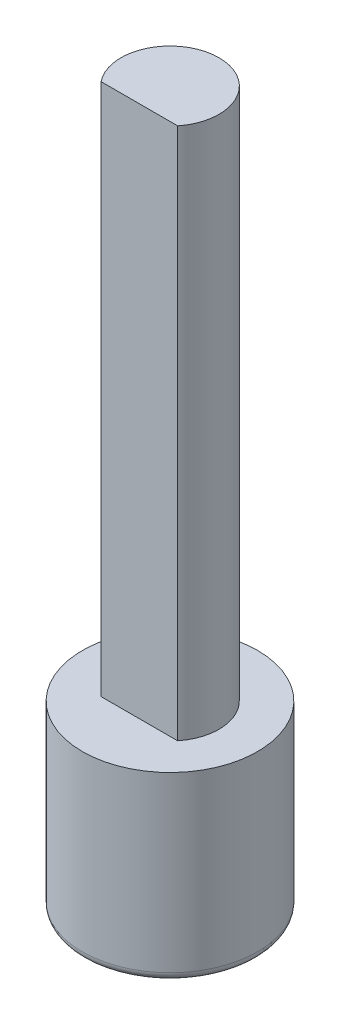
ISO-10303-21;
HEADER;
FILE_DESCRIPTION(('STEP AP214'),'2;1');
FILE_NAME('part.step','',(''),(''),'','','');
FILE_SCHEMA(('AUTOMOTIVE_DESIGN { 1 0 10303 214 1 1 1 1 }'));
ENDSEC;
DATA;
#1=APPLICATION_CONTEXT('core data for automotive mechanical design processes');
#2=APPLICATION_PROTOCOL_DEFINITION('international standard','automotive_design',2000,#1);
#3=PRODUCT_CONTEXT('',#1,'mechanical');
#4=PRODUCT('Part','Part','',(#3));
#5=PRODUCT_RELATED_PRODUCT_CATEGORY('part','',(#4));
#6=PRODUCT_DEFINITION_FORMATION('','',#4);
#7=PRODUCT_DEFINITION_CONTEXT('part definition',#1,'design');
#8=PRODUCT_DEFINITION('design','',#6,#7);
#9=PRODUCT_DEFINITION_SHAPE('','',#8);
#10=(LENGTH_UNIT() NAMED_UNIT(*) SI_UNIT(.MILLI.,.METRE.));
#11=(NAMED_UNIT(*) PLANE_ANGLE_UNIT() SI_UNIT($,.RADIAN.));
#12=(NAMED_UNIT(*) SI_UNIT($,.STERADIAN.) SOLID_ANGLE_UNIT());
#13=UNCERTAINTY_MEASURE_WITH_UNIT(LENGTH_MEASURE(1.E-05),#10,'distance_accuracy_value','');
#14=(GEOMETRIC_REPRESENTATION_CONTEXT(3) GLOBAL_UNCERTAINTY_ASSIGNED_CONTEXT((#13)) GLOBAL_UNIT_ASSIGNED_CONTEXT((#10,
#11,#12)) REPRESENTATION_CONTEXT('',''));
#15=CARTESIAN_POINT('',(0.,0.,0.));
#16=DIRECTION('',(0.,0.,1.));
#17=DIRECTION('',(1.,0.,0.));
#18=AXIS2_PLACEMENT_3D('',#15,#16,#17);
#19=CARTESIAN_POINT('',(0.,0.,0.));
#20=DIRECTION('',(0.,1.,0.));
#21=DIRECTION('',(0.,0.,1.));
#22=AXIS2_PLACEMENT_3D('',#19,#20,#21);
#23=PLANE('',#22);
#24=CARTESIAN_POINT('',(0.,0.,0.));
#25=DIRECTION('',(0.,1.,0.));
#26=DIRECTION('',(0.,0.,1.));
#27=AXIS2_PLACEMENT_3D('',#24,#25,#26);
#28=CIRCLE('',#27,2.25);
#29=CARTESIAN_POINT('',(0.,0.,2.25));
#30=VERTEX_POINT('',#29);
#31=EDGE_CURVE('E11',#30,#30,#28,.F.);
#32=ORIENTED_EDGE('',*,*,#31,.T.);
#33=EDGE_LOOP('',(#32));
#34=FACE_BOUND('',#33,.T.);
#35=ADVANCED_FACE('F45',(#34),#23,.F.);
#36=CARTESIAN_POINT('',(0.,20.4,0.));
#37=DIRECTION('',(0.,1.,0.));
#38=DIRECTION('',(0.,0.,1.));
#39=AXIS2_PLACEMENT_3D('',#36,#37,#38);
#40=CYLINDRICAL_SURFACE('',#39,2.5);
#41=CARTESIAN_POINT('',(0.,0.25,0.));
#42=DIRECTION('',(0.,1.,0.));
#43=DIRECTION('',(0.,0.,1.));
#44=AXIS2_PLACEMENT_3D('',#41,#42,#43);
#45=CIRCLE('',#44,2.5);
#46=CARTESIAN_POINT('',(0.,0.25,2.5));
#47=VERTEX_POINT('',#46);
#48=EDGE_CURVE('E54',#47,#47,#45,.T.);
#49=ORIENTED_EDGE('',*,*,#48,.T.);
#50=EDGE_LOOP('',(#49));
#51=FACE_BOUND('',#50,.T.);
#52=CARTESIAN_POINT('',(0.,5.2,0.));
#53=DIRECTION('',(0.,1.,0.));
#54=DIRECTION('',(0.,0.,1.));
#55=AXIS2_PLACEMENT_3D('',#52,#53,#54);
#56=CIRCLE('',#55,2.5);
#57=CARTESIAN_POINT('',(0.,5.2,2.5));
#58=VERTEX_POINT('',#57);
#59=EDGE_CURVE('E89',#58,#58,#56,.T.);
#60=ORIENTED_EDGE('',*,*,#59,.F.);
#61=EDGE_LOOP('',(#60));
#62=FACE_BOUND('',#61,.T.);
#63=ADVANCED_FACE('F102',(#51,#62),#40,.T.);
#64=CARTESIAN_POINT('',(0.,5.2,-2.5));
#65=DIRECTION('',(0.,-1.,0.));
#66=DIRECTION('',(0.,0.,-1.));
#67=AXIS2_PLACEMENT_3D('',#64,#65,#66);
#68=PLANE('',#67);
#69=CARTESIAN_POINT('',(0.,5.2,0.));
#70=DIRECTION('',(0.,1.,0.));
#71=DIRECTION('',(0.,0.,1.));
#72=AXIS2_PLACEMENT_3D('',#69,#70,#71);
#73=CIRCLE('',#72,1.4);
#74=CARTESIAN_POINT('',(1.09287464971972,5.2,0.875));
#75=VERTEX_POINT('',#74);
#76=CARTESIAN_POINT('',(-1.09287464971972,5.2,0.875));
#77=VERTEX_POINT('',#76);
#78=EDGE_CURVE('E84',#75,#77,#73,.T.);
#79=ORIENTED_EDGE('',*,*,#78,.F.);
#80=DIRECTION('',(-1.,0.,0.));
#81=VECTOR('',#80,1.);
#82=CARTESIAN_POINT('',(1.09287464971972,5.2,0.875));
#83=LINE('',#82,#81);
#84=EDGE_CURVE('E73',#75,#77,#83,.T.);
#85=ORIENTED_EDGE('',*,*,#84,.T.);
#86=EDGE_LOOP('',(#79,#85));
#87=FACE_BOUND('',#86,.T.);
#88=ORIENTED_EDGE('',*,*,#59,.T.);
#89=EDGE_LOOP('',(#88));
#90=FACE_BOUND('',#89,.T.);
#91=ADVANCED_FACE('F82',(#87,#90),#68,.F.);
#92=CARTESIAN_POINT('',(0.,20.4,0.));
#93=DIRECTION('',(0.,1.,0.));
#94=DIRECTION('',(0.,0.,1.));
#95=AXIS2_PLACEMENT_3D('',#92,#93,#94);
#96=CYLINDRICAL_SURFACE('',#95,1.4);
#97=ORIENTED_EDGE('',*,*,#78,.T.);
#98=DIRECTION('',(0.,1.,0.));
#99=VECTOR('',#98,1.);
#100=CARTESIAN_POINT('',(-1.09287464971972,2.9520842987336,0.875));
#101=LINE('',#100,#99);
#102=CARTESIAN_POINT('',(-1.09287464971972,20.4,0.875));
#103=VERTEX_POINT('',#102);
#104=EDGE_CURVE('E70',#77,#103,#101,.T.);
#105=ORIENTED_EDGE('',*,*,#104,.T.);
#106=CARTESIAN_POINT('',(0.,20.4,0.));
#107=DIRECTION('',(0.,1.,0.));
#108=DIRECTION('',(0.,0.,1.));
#109=AXIS2_PLACEMENT_3D('',#106,#107,#108);
#110=CIRCLE('',#109,1.4);
#111=CARTESIAN_POINT('',(1.09287464971972,20.4,0.875));
#112=VERTEX_POINT('',#111);
#113=EDGE_CURVE('E90',#112,#103,#110,.T.);
#114=ORIENTED_EDGE('',*,*,#113,.F.);
#115=DIRECTION('',(0.,1.,0.));
#116=VECTOR('',#115,1.);
#117=CARTESIAN_POINT('',(1.09287464971972,2.9520842987336,0.875));
#118=LINE('',#117,#116);
#119=EDGE_CURVE('E61',#75,#112,#118,.T.);
#120=ORIENTED_EDGE('',*,*,#119,.F.);
#121=EDGE_LOOP('',(#97,#105,#114,#120));
#122=FACE_BOUND('',#121,.T.);
#123=ADVANCED_FACE('F87',(#122),#96,.T.);
#124=CARTESIAN_POINT('',(0.,20.4,-1.4));
#125=DIRECTION('',(0.,-1.,0.));
#126=DIRECTION('',(0.,0.,-1.));
#127=AXIS2_PLACEMENT_3D('',#124,#125,#126);
#128=PLANE('',#127);
#129=ORIENTED_EDGE('',*,*,#113,.T.);
#130=DIRECTION('',(-1.,0.,0.));
#131=VECTOR('',#130,1.);
#132=CARTESIAN_POINT('',(1.09287464971972,20.4,0.875));
#133=LINE('',#132,#131);
#134=EDGE_CURVE('E66',#112,#103,#133,.T.);
#135=ORIENTED_EDGE('',*,*,#134,.F.);
#136=EDGE_LOOP('',(#129,#135));
#137=FACE_BOUND('',#136,.T.);
#138=ADVANCED_FACE('F106',(#137),#128,.F.);
#139=CARTESIAN_POINT('',(0.,0.25,0.));
#140=DIRECTION('',(0.,1.,0.));
#141=DIRECTION('',(0.,0.,1.));
#142=AXIS2_PLACEMENT_3D('',#139,#140,#141);
#143=TOROIDAL_SURFACE('',#142,2.25,0.25);
#144=ORIENTED_EDGE('',*,*,#31,.F.);
#145=EDGE_LOOP('',(#144));
#146=FACE_BOUND('',#145,.T.);
#147=ORIENTED_EDGE('',*,*,#48,.F.);
#148=EDGE_LOOP('',(#147));
#149=FACE_BOUND('',#148,.T.);
#150=ADVANCED_FACE('F47',(#146,#149),#143,.T.);
#151=CARTESIAN_POINT('',(1.09287464971972,2.9520842987336,0.875));
#152=DIRECTION('',(0.,0.,-1.));
#153=DIRECTION('',(-1.,0.,0.));
#154=AXIS2_PLACEMENT_3D('',#151,#152,#153);
#155=PLANE('',#154);
#156=ORIENTED_EDGE('',*,*,#119,.T.);
#157=ORIENTED_EDGE('',*,*,#134,.T.);
#158=ORIENTED_EDGE('',*,*,#104,.F.);
#159=ORIENTED_EDGE('',*,*,#84,.F.);
#160=EDGE_LOOP('',(#156,#157,#158,#159));
#161=FACE_BOUND('',#160,.T.);
#162=ADVANCED_FACE('F72',(#161),#155,.F.);
#163=CLOSED_SHELL('',(#35,#63,#91,#123,#138,#150,#162));
#164=MANIFOLD_SOLID_BREP('B2',#163);
#165=ADVANCED_BREP_SHAPE_REPRESENTATION('',(#18,#164),#14);
#166=SHAPE_DEFINITION_REPRESENTATION(#9,#165);
ENDSEC;
END-ISO-10303-21;
